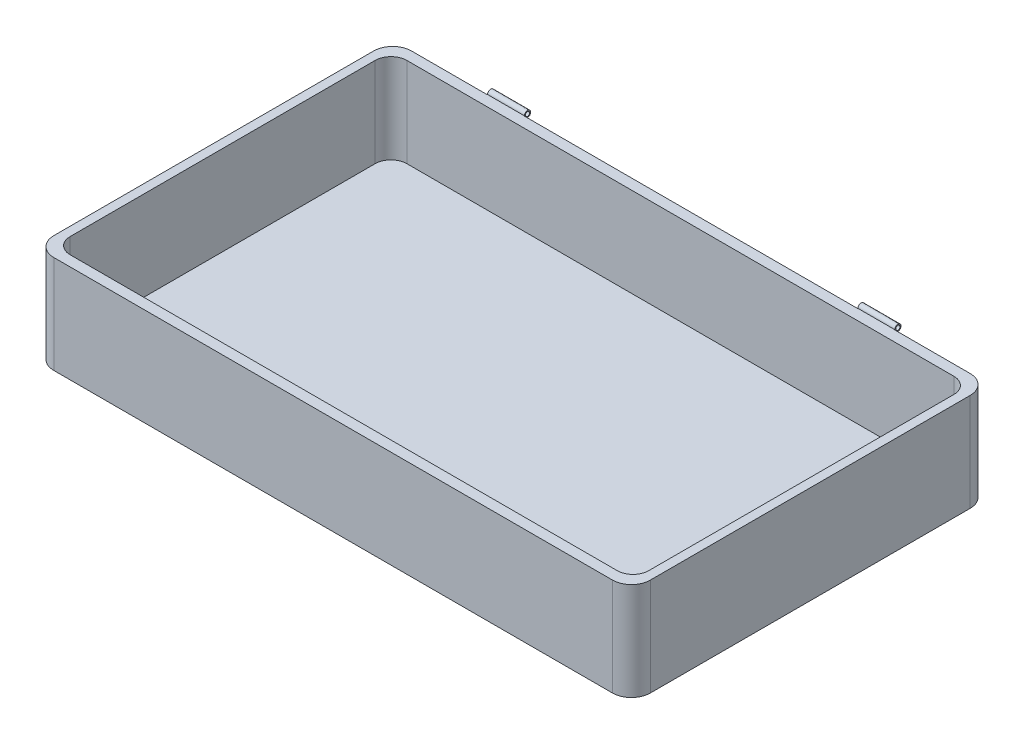
ISO-10303-21;
HEADER;
FILE_DESCRIPTION(('STEP AP214'),'2;1');
FILE_NAME('part.step','',(''),(''),'','','');
FILE_SCHEMA(('AUTOMOTIVE_DESIGN { 1 0 10303 214 1 1 1 1 }'));
ENDSEC;
DATA;
#1=APPLICATION_CONTEXT('core data for automotive mechanical design processes');
#2=APPLICATION_PROTOCOL_DEFINITION('international standard','automotive_design',2000,#1);
#3=PRODUCT_CONTEXT('',#1,'mechanical');
#4=PRODUCT('Part','Part','',(#3));
#5=PRODUCT_RELATED_PRODUCT_CATEGORY('part','',(#4));
#6=PRODUCT_DEFINITION_FORMATION('','',#4);
#7=PRODUCT_DEFINITION_CONTEXT('part definition',#1,'design');
#8=PRODUCT_DEFINITION('design','',#6,#7);
#9=PRODUCT_DEFINITION_SHAPE('','',#8);
#10=(LENGTH_UNIT() NAMED_UNIT(*) SI_UNIT(.MILLI.,.METRE.));
#11=(NAMED_UNIT(*) PLANE_ANGLE_UNIT() SI_UNIT($,.RADIAN.));
#12=(NAMED_UNIT(*) SI_UNIT($,.STERADIAN.) SOLID_ANGLE_UNIT());
#13=UNCERTAINTY_MEASURE_WITH_UNIT(LENGTH_MEASURE(1.E-05),#10,'distance_accuracy_value','');
#14=(GEOMETRIC_REPRESENTATION_CONTEXT(3) GLOBAL_UNCERTAINTY_ASSIGNED_CONTEXT((#13)) GLOBAL_UNIT_ASSIGNED_CONTEXT((#10,
#11,#12)) REPRESENTATION_CONTEXT('',''));
#15=CARTESIAN_POINT('',(0.,0.,0.));
#16=DIRECTION('',(0.,0.,1.));
#17=DIRECTION('',(1.,0.,0.));
#18=AXIS2_PLACEMENT_3D('',#15,#16,#17);
#19=CARTESIAN_POINT('',(0.,93.,0.));
#20=DIRECTION('',(0.,-1.,0.));
#21=DIRECTION('',(0.,0.,-1.));
#22=AXIS2_PLACEMENT_3D('',#19,#20,#21);
#23=PLANE('',#22);
#24=DIRECTION('',(0.,0.,-1.));
#25=VECTOR('',#24,1.);
#26=CARTESIAN_POINT('',(275.,93.,145.));
#27=LINE('',#26,#25);
#28=CARTESIAN_POINT('',(275.,93.,145.));
#29=VERTEX_POINT('',#28);
#30=CARTESIAN_POINT('',(275.,93.,-145.));
#31=VERTEX_POINT('',#30);
#32=EDGE_CURVE('E422',#29,#31,#27,.T.);
#33=ORIENTED_EDGE('',*,*,#32,.F.);
#34=CARTESIAN_POINT('',(260.,93.,145.));
#35=DIRECTION('',(0.,1.,0.));
#36=DIRECTION('',(0.,0.,1.));
#37=AXIS2_PLACEMENT_3D('',#34,#35,#36);
#38=CIRCLE('',#37,15.);
#39=CARTESIAN_POINT('',(260.,93.,160.));
#40=VERTEX_POINT('',#39);
#41=EDGE_CURVE('E394',#40,#29,#38,.T.);
#42=ORIENTED_EDGE('',*,*,#41,.F.);
#43=DIRECTION('',(1.,0.,0.));
#44=VECTOR('',#43,1.);
#45=CARTESIAN_POINT('',(-260.,93.,160.));
#46=LINE('',#45,#44);
#47=CARTESIAN_POINT('',(-260.,93.,160.));
#48=VERTEX_POINT('',#47);
#49=EDGE_CURVE('E399',#48,#40,#46,.T.);
#50=ORIENTED_EDGE('',*,*,#49,.F.);
#51=CARTESIAN_POINT('',(-260.,93.,145.));
#52=DIRECTION('',(0.,1.,0.));
#53=DIRECTION('',(0.,0.,1.));
#54=AXIS2_PLACEMENT_3D('',#51,#52,#53);
#55=CIRCLE('',#54,15.);
#56=CARTESIAN_POINT('',(-275.,93.,145.));
#57=VERTEX_POINT('',#56);
#58=EDGE_CURVE('E437',#57,#48,#55,.T.);
#59=ORIENTED_EDGE('',*,*,#58,.F.);
#60=DIRECTION('',(0.,0.,1.));
#61=VECTOR('',#60,1.);
#62=CARTESIAN_POINT('',(-275.,93.,145.));
#63=LINE('',#62,#61);
#64=CARTESIAN_POINT('',(-275.,93.,-145.));
#65=VERTEX_POINT('',#64);
#66=EDGE_CURVE('E434',#65,#57,#63,.T.);
#67=ORIENTED_EDGE('',*,*,#66,.F.);
#68=CARTESIAN_POINT('',(-260.,93.,-145.));
#69=DIRECTION('',(0.,1.,0.));
#70=DIRECTION('',(0.,0.,-1.));
#71=AXIS2_PLACEMENT_3D('',#68,#69,#70);
#72=CIRCLE('',#71,15.);
#73=CARTESIAN_POINT('',(-260.,93.,-160.));
#74=VERTEX_POINT('',#73);
#75=EDGE_CURVE('E431',#74,#65,#72,.T.);
#76=ORIENTED_EDGE('',*,*,#75,.F.);
#77=DIRECTION('',(-1.,0.,0.));
#78=VECTOR('',#77,1.);
#79=CARTESIAN_POINT('',(-260.,93.,-160.));
#80=LINE('',#79,#78);
#81=CARTESIAN_POINT('',(260.,93.,-160.));
#82=VERTEX_POINT('',#81);
#83=EDGE_CURVE('E428',#82,#74,#80,.T.);
#84=ORIENTED_EDGE('',*,*,#83,.F.);
#85=CARTESIAN_POINT('',(260.,93.,-145.));
#86=DIRECTION('',(0.,1.,0.));
#87=DIRECTION('',(0.,0.,1.));
#88=AXIS2_PLACEMENT_3D('',#85,#86,#87);
#89=CIRCLE('',#88,15.);
#90=EDGE_CURVE('E425',#31,#82,#89,.T.);
#91=ORIENTED_EDGE('',*,*,#90,.F.);
#92=EDGE_LOOP('',(#33,#42,#50,#59,#67,#76,#84,#91));
#93=FACE_BOUND('',#92,.T.);
#94=DIRECTION('',(-1.,0.,0.));
#95=VECTOR('',#94,1.);
#96=CARTESIAN_POINT('',(-158.5,93.,-170.25));
#97=LINE('',#96,#95);
#98=CARTESIAN_POINT('',(-193.5,93.,-170.25));
#99=VERTEX_POINT('',#98);
#100=CARTESIAN_POINT('',(-158.5,93.,-170.25));
#101=VERTEX_POINT('',#100);
#102=EDGE_CURVE('E341',#99,#101,#97,.F.);
#103=ORIENTED_EDGE('',*,*,#102,.F.);
#104=DIRECTION('',(0.,0.,1.));
#105=VECTOR('',#104,1.);
#106=CARTESIAN_POINT('',(-193.5,93.,-170.));
#107=LINE('',#106,#105);
#108=CARTESIAN_POINT('',(-193.5,93.,-170.));
#109=VERTEX_POINT('',#108);
#110=EDGE_CURVE('E340',#99,#109,#107,.T.);
#111=ORIENTED_EDGE('',*,*,#110,.T.);
#112=DIRECTION('',(-1.,0.,0.));
#113=VECTOR('',#112,1.);
#114=CARTESIAN_POINT('',(-283.5,93.,-170.));
#115=LINE('',#114,#113);
#116=CARTESIAN_POINT('',(-265.5,93.,-170.));
#117=VERTEX_POINT('',#116);
#118=EDGE_CURVE('E232',#109,#117,#115,.T.);
#119=ORIENTED_EDGE('',*,*,#118,.T.);
#120=CARTESIAN_POINT('',(-265.5,93.,-152.));
#121=DIRECTION('',(0.,-1.,0.));
#122=DIRECTION('',(0.,0.,-1.));
#123=AXIS2_PLACEMENT_3D('',#120,#121,#122);
#124=CIRCLE('',#123,18.);
#125=CARTESIAN_POINT('',(-283.5,93.,-152.));
#126=VERTEX_POINT('',#125);
#127=EDGE_CURVE('E287',#117,#126,#124,.F.);
#128=ORIENTED_EDGE('',*,*,#127,.T.);
#129=DIRECTION('',(0.,0.,1.));
#130=VECTOR('',#129,1.);
#131=CARTESIAN_POINT('',(-283.5,93.,170.));
#132=LINE('',#131,#130);
#133=CARTESIAN_POINT('',(-283.5,93.,152.));
#134=VERTEX_POINT('',#133);
#135=EDGE_CURVE('E238',#126,#134,#132,.T.);
#136=ORIENTED_EDGE('',*,*,#135,.T.);
#137=CARTESIAN_POINT('',(-265.5,93.,152.));
#138=DIRECTION('',(0.,-1.,0.));
#139=DIRECTION('',(0.,0.,-1.));
#140=AXIS2_PLACEMENT_3D('',#137,#138,#139);
#141=CIRCLE('',#140,18.);
#142=CARTESIAN_POINT('',(-265.5,93.,170.));
#143=VERTEX_POINT('',#142);
#144=EDGE_CURVE('E285',#134,#143,#141,.F.);
#145=ORIENTED_EDGE('',*,*,#144,.T.);
#146=DIRECTION('',(1.,0.,0.));
#147=VECTOR('',#146,1.);
#148=CARTESIAN_POINT('',(-283.5,93.,170.));
#149=LINE('',#148,#147);
#150=CARTESIAN_POINT('',(265.5,93.,170.));
#151=VERTEX_POINT('',#150);
#152=EDGE_CURVE('E245',#143,#151,#149,.T.);
#153=ORIENTED_EDGE('',*,*,#152,.T.);
#154=CARTESIAN_POINT('',(265.5,93.,152.));
#155=DIRECTION('',(0.,-1.,0.));
#156=DIRECTION('',(0.,0.,-1.));
#157=AXIS2_PLACEMENT_3D('',#154,#155,#156);
#158=CIRCLE('',#157,18.);
#159=CARTESIAN_POINT('',(283.5,93.,152.));
#160=VERTEX_POINT('',#159);
#161=EDGE_CURVE('E280',#151,#160,#158,.F.);
#162=ORIENTED_EDGE('',*,*,#161,.T.);
#163=DIRECTION('',(0.,0.,-1.));
#164=VECTOR('',#163,1.);
#165=CARTESIAN_POINT('',(283.5,93.,170.));
#166=LINE('',#165,#164);
#167=CARTESIAN_POINT('',(283.5,93.,-152.));
#168=VERTEX_POINT('',#167);
#169=EDGE_CURVE('E239',#160,#168,#166,.T.);
#170=ORIENTED_EDGE('',*,*,#169,.T.);
#171=CARTESIAN_POINT('',(265.5,93.,-152.));
#172=DIRECTION('',(0.,-1.,0.));
#173=DIRECTION('',(0.,0.,-1.));
#174=AXIS2_PLACEMENT_3D('',#171,#172,#173);
#175=CIRCLE('',#174,18.);
#176=CARTESIAN_POINT('',(265.5,93.,-170.));
#177=VERTEX_POINT('',#176);
#178=EDGE_CURVE('E282',#168,#177,#175,.F.);
#179=ORIENTED_EDGE('',*,*,#178,.T.);
#180=CARTESIAN_POINT('',(193.5,93.,-170.));
#181=VERTEX_POINT('',#180);
#182=EDGE_CURVE('E231',#177,#181,#115,.T.);
#183=ORIENTED_EDGE('',*,*,#182,.T.);
#184=DIRECTION('',(0.,0.,1.));
#185=VECTOR('',#184,1.);
#186=CARTESIAN_POINT('',(193.5,93.,-170.));
#187=LINE('',#186,#185);
#188=CARTESIAN_POINT('',(193.5,93.,-170.25));
#189=VERTEX_POINT('',#188);
#190=EDGE_CURVE('E319',#189,#181,#187,.T.);
#191=ORIENTED_EDGE('',*,*,#190,.F.);
#192=DIRECTION('',(1.,0.,0.));
#193=VECTOR('',#192,1.);
#194=CARTESIAN_POINT('',(158.5,93.,-170.25));
#195=LINE('',#194,#193);
#196=CARTESIAN_POINT('',(158.5,93.,-170.25));
#197=VERTEX_POINT('',#196);
#198=EDGE_CURVE('E371',#189,#197,#195,.F.);
#199=ORIENTED_EDGE('',*,*,#198,.T.);
#200=DIRECTION('',(0.,0.,1.));
#201=VECTOR('',#200,1.);
#202=CARTESIAN_POINT('',(158.5,93.,-170.));
#203=LINE('',#202,#201);
#204=CARTESIAN_POINT('',(158.5,93.,-170.));
#205=VERTEX_POINT('',#204);
#206=EDGE_CURVE('E228',#197,#205,#203,.T.);
#207=ORIENTED_EDGE('',*,*,#206,.T.);
#208=CARTESIAN_POINT('',(-158.5,93.,-170.));
#209=VERTEX_POINT('',#208);
#210=EDGE_CURVE('E220',#205,#209,#115,.T.);
#211=ORIENTED_EDGE('',*,*,#210,.T.);
#212=DIRECTION('',(0.,0.,1.));
#213=VECTOR('',#212,1.);
#214=CARTESIAN_POINT('',(-158.5,93.,-170.));
#215=LINE('',#214,#213);
#216=EDGE_CURVE('E54',#101,#209,#215,.T.);
#217=ORIENTED_EDGE('',*,*,#216,.F.);
#218=EDGE_LOOP('',(#103,#111,#119,#128,#136,#145,#153,#162,#170,#179,#183,#191,#199,#207,#211,#217));
#219=FACE_BOUND('',#218,.T.);
#220=ADVANCED_FACE('F39',(#93,#219),#23,.F.);
#221=CARTESIAN_POINT('',(-158.5,92.,-170.));
#222=DIRECTION('',(0.,1.,0.));
#223=DIRECTION('',(0.,0.,1.));
#224=AXIS2_PLACEMENT_3D('',#221,#222,#223);
#225=PLANE('',#224);
#226=DIRECTION('',(-1.,0.,0.));
#227=VECTOR('',#226,1.);
#228=CARTESIAN_POINT('',(-158.5,92.,-170.421572875254));
#229=LINE('',#228,#227);
#230=CARTESIAN_POINT('',(-158.5,92.,-170.421572875254));
#231=VERTEX_POINT('',#230);
#232=CARTESIAN_POINT('',(-193.5,92.,-170.421572875254));
#233=VERTEX_POINT('',#232);
#234=EDGE_CURVE('E62',#231,#233,#229,.T.);
#235=ORIENTED_EDGE('',*,*,#234,.F.);
#236=DIRECTION('',(0.,0.,-1.));
#237=VECTOR('',#236,1.);
#238=CARTESIAN_POINT('',(-158.5,92.,-170.));
#239=LINE('',#238,#237);
#240=CARTESIAN_POINT('',(-158.5,92.,-170.));
#241=VERTEX_POINT('',#240);
#242=EDGE_CURVE('E214',#241,#231,#239,.T.);
#243=ORIENTED_EDGE('',*,*,#242,.F.);
#244=DIRECTION('',(-1.,0.,0.));
#245=VECTOR('',#244,1.);
#246=CARTESIAN_POINT('',(-158.5,92.,-170.));
#247=LINE('',#246,#245);
#248=CARTESIAN_POINT('',(-193.5,92.,-170.));
#249=VERTEX_POINT('',#248);
#250=EDGE_CURVE('E223',#241,#249,#247,.T.);
#251=ORIENTED_EDGE('',*,*,#250,.T.);
#252=DIRECTION('',(0.,0.,-1.));
#253=VECTOR('',#252,1.);
#254=CARTESIAN_POINT('',(-193.5,92.,-170.));
#255=LINE('',#254,#253);
#256=EDGE_CURVE('E224',#249,#233,#255,.T.);
#257=ORIENTED_EDGE('',*,*,#256,.T.);
#258=EDGE_LOOP('',(#235,#243,#251,#257));
#259=FACE_BOUND('',#258,.T.);
#260=ADVANCED_FACE('F499',(#259),#225,.F.);
#261=CARTESIAN_POINT('',(-283.5,93.,-170.));
#262=DIRECTION('',(0.,0.,1.));
#263=DIRECTION('',(1.,0.,0.));
#264=AXIS2_PLACEMENT_3D('',#261,#262,#263);
#265=PLANE('',#264);
#266=DIRECTION('',(0.,-1.,0.));
#267=VECTOR('',#266,1.);
#268=CARTESIAN_POINT('',(-158.5,93.,-170.));
#269=LINE('',#268,#267);
#270=EDGE_CURVE('E210',#209,#241,#269,.T.);
#271=ORIENTED_EDGE('',*,*,#270,.F.);
#272=ORIENTED_EDGE('',*,*,#210,.F.);
#273=DIRECTION('',(0.,-1.,0.));
#274=VECTOR('',#273,1.);
#275=CARTESIAN_POINT('',(158.5,93.,-170.));
#276=LINE('',#275,#274);
#277=CARTESIAN_POINT('',(158.5,92.,-170.));
#278=VERTEX_POINT('',#277);
#279=EDGE_CURVE('E374',#205,#278,#276,.T.);
#280=ORIENTED_EDGE('',*,*,#279,.T.);
#281=DIRECTION('',(1.,0.,0.));
#282=VECTOR('',#281,1.);
#283=CARTESIAN_POINT('',(158.5,92.,-170.));
#284=LINE('',#283,#282);
#285=CARTESIAN_POINT('',(193.5,92.,-170.));
#286=VERTEX_POINT('',#285);
#287=EDGE_CURVE('E383',#278,#286,#284,.T.);
#288=ORIENTED_EDGE('',*,*,#287,.T.);
#289=DIRECTION('',(0.,-1.,0.));
#290=VECTOR('',#289,1.);
#291=CARTESIAN_POINT('',(193.5,93.,-170.));
#292=LINE('',#291,#290);
#293=EDGE_CURVE('E317',#181,#286,#292,.T.);
#294=ORIENTED_EDGE('',*,*,#293,.F.);
#295=ORIENTED_EDGE('',*,*,#182,.F.);
#296=DIRECTION('',(0.,-1.,0.));
#297=VECTOR('',#296,1.);
#298=CARTESIAN_POINT('',(265.5,93.,-170.));
#299=LINE('',#298,#297);
#300=CARTESIAN_POINT('',(265.5,0.,-170.));
#301=VERTEX_POINT('',#300);
#302=EDGE_CURVE('E274',#177,#301,#299,.T.);
#303=ORIENTED_EDGE('',*,*,#302,.T.);
#304=DIRECTION('',(-1.,0.,0.));
#305=VECTOR('',#304,1.);
#306=CARTESIAN_POINT('',(-283.5,0.,-170.));
#307=LINE('',#306,#305);
#308=CARTESIAN_POINT('',(-265.5,0.,-170.));
#309=VERTEX_POINT('',#308);
#310=EDGE_CURVE('E252',#301,#309,#307,.T.);
#311=ORIENTED_EDGE('',*,*,#310,.T.);
#312=DIRECTION('',(0.,-1.,0.));
#313=VECTOR('',#312,1.);
#314=CARTESIAN_POINT('',(-265.5,93.,-170.));
#315=LINE('',#314,#313);
#316=EDGE_CURVE('E277',#309,#117,#315,.F.);
#317=ORIENTED_EDGE('',*,*,#316,.T.);
#318=ORIENTED_EDGE('',*,*,#118,.F.);
#319=DIRECTION('',(0.,-1.,0.));
#320=VECTOR('',#319,1.);
#321=CARTESIAN_POINT('',(-193.5,93.,-170.));
#322=LINE('',#321,#320);
#323=EDGE_CURVE('E338',#109,#249,#322,.T.);
#324=ORIENTED_EDGE('',*,*,#323,.T.);
#325=ORIENTED_EDGE('',*,*,#250,.F.);
#326=EDGE_LOOP('',(#271,#272,#280,#288,#294,#295,#303,#311,#317,#318,#324,#325));
#327=FACE_BOUND('',#326,.T.);
#328=ADVANCED_FACE('F218',(#327),#265,.F.);
#329=CARTESIAN_POINT('',(283.5,93.,170.));
#330=DIRECTION('',(-1.,0.,0.));
#331=DIRECTION('',(0.,0.,1.));
#332=AXIS2_PLACEMENT_3D('',#329,#330,#331);
#333=PLANE('',#332);
#334=DIRECTION('',(0.,0.,-1.));
#335=VECTOR('',#334,1.);
#336=CARTESIAN_POINT('',(283.5,0.,170.));
#337=LINE('',#336,#335);
#338=CARTESIAN_POINT('',(283.5,0.,152.));
#339=VERTEX_POINT('',#338);
#340=CARTESIAN_POINT('',(283.5,0.,-152.));
#341=VERTEX_POINT('',#340);
#342=EDGE_CURVE('E249',#339,#341,#337,.T.);
#343=ORIENTED_EDGE('',*,*,#342,.T.);
#344=DIRECTION('',(0.,-1.,0.));
#345=VECTOR('',#344,1.);
#346=CARTESIAN_POINT('',(283.5,93.,-152.));
#347=LINE('',#346,#345);
#348=EDGE_CURVE('E11',#341,#168,#347,.F.);
#349=ORIENTED_EDGE('',*,*,#348,.T.);
#350=ORIENTED_EDGE('',*,*,#169,.F.);
#351=DIRECTION('',(0.,-1.,0.));
#352=VECTOR('',#351,1.);
#353=CARTESIAN_POINT('',(283.5,93.,152.));
#354=LINE('',#353,#352);
#355=EDGE_CURVE('E47',#160,#339,#354,.T.);
#356=ORIENTED_EDGE('',*,*,#355,.T.);
#357=EDGE_LOOP('',(#343,#349,#350,#356));
#358=FACE_BOUND('',#357,.T.);
#359=ADVANCED_FACE('F298',(#358),#333,.F.);
#360=CARTESIAN_POINT('',(-283.5,93.,170.));
#361=DIRECTION('',(1.,0.,0.));
#362=DIRECTION('',(0.,0.,-1.));
#363=AXIS2_PLACEMENT_3D('',#360,#361,#362);
#364=PLANE('',#363);
#365=ORIENTED_EDGE('',*,*,#135,.F.);
#366=DIRECTION('',(0.,-1.,0.));
#367=VECTOR('',#366,1.);
#368=CARTESIAN_POINT('',(-283.5,93.,-152.));
#369=LINE('',#368,#367);
#370=CARTESIAN_POINT('',(-283.5,0.,-152.));
#371=VERTEX_POINT('',#370);
#372=EDGE_CURVE('E263',#126,#371,#369,.T.);
#373=ORIENTED_EDGE('',*,*,#372,.T.);
#374=DIRECTION('',(0.,0.,1.));
#375=VECTOR('',#374,1.);
#376=CARTESIAN_POINT('',(-283.5,0.,170.));
#377=LINE('',#376,#375);
#378=CARTESIAN_POINT('',(-283.5,0.,152.));
#379=VERTEX_POINT('',#378);
#380=EDGE_CURVE('E256',#371,#379,#377,.T.);
#381=ORIENTED_EDGE('',*,*,#380,.T.);
#382=DIRECTION('',(0.,-1.,0.));
#383=VECTOR('',#382,1.);
#384=CARTESIAN_POINT('',(-283.5,93.,152.));
#385=LINE('',#384,#383);
#386=EDGE_CURVE('E248',#379,#134,#385,.F.);
#387=ORIENTED_EDGE('',*,*,#386,.T.);
#388=EDGE_LOOP('',(#365,#373,#381,#387));
#389=FACE_BOUND('',#388,.T.);
#390=ADVANCED_FACE('F329',(#389),#364,.F.);
#391=CARTESIAN_POINT('',(-283.5,93.,170.));
#392=DIRECTION('',(0.,0.,-1.));
#393=DIRECTION('',(-1.,0.,0.));
#394=AXIS2_PLACEMENT_3D('',#391,#392,#393);
#395=PLANE('',#394);
#396=ORIENTED_EDGE('',*,*,#152,.F.);
#397=DIRECTION('',(0.,-1.,0.));
#398=VECTOR('',#397,1.);
#399=CARTESIAN_POINT('',(-265.5,93.,170.));
#400=LINE('',#399,#398);
#401=CARTESIAN_POINT('',(-265.5,0.,170.));
#402=VERTEX_POINT('',#401);
#403=EDGE_CURVE('E291',#143,#402,#400,.T.);
#404=ORIENTED_EDGE('',*,*,#403,.T.);
#405=DIRECTION('',(1.,0.,0.));
#406=VECTOR('',#405,1.);
#407=CARTESIAN_POINT('',(-283.5,0.,170.));
#408=LINE('',#407,#406);
#409=CARTESIAN_POINT('',(265.5,0.,170.));
#410=VERTEX_POINT('',#409);
#411=EDGE_CURVE('E259',#402,#410,#408,.T.);
#412=ORIENTED_EDGE('',*,*,#411,.T.);
#413=DIRECTION('',(0.,-1.,0.));
#414=VECTOR('',#413,1.);
#415=CARTESIAN_POINT('',(265.5,93.,170.));
#416=LINE('',#415,#414);
#417=EDGE_CURVE('E289',#410,#151,#416,.F.);
#418=ORIENTED_EDGE('',*,*,#417,.T.);
#419=EDGE_LOOP('',(#396,#404,#412,#418));
#420=FACE_BOUND('',#419,.T.);
#421=ADVANCED_FACE('F323',(#420),#395,.F.);
#422=CARTESIAN_POINT('',(0.,0.,0.));
#423=DIRECTION('',(0.,-1.,0.));
#424=DIRECTION('',(0.,0.,-1.));
#425=AXIS2_PLACEMENT_3D('',#422,#423,#424);
#426=PLANE('',#425);
#427=ORIENTED_EDGE('',*,*,#380,.F.);
#428=CARTESIAN_POINT('',(-265.5,0.,-152.));
#429=DIRECTION('',(0.,-1.,0.));
#430=DIRECTION('',(0.,0.,-1.));
#431=AXIS2_PLACEMENT_3D('',#428,#429,#430);
#432=CIRCLE('',#431,18.);
#433=EDGE_CURVE('E272',#371,#309,#432,.T.);
#434=ORIENTED_EDGE('',*,*,#433,.T.);
#435=ORIENTED_EDGE('',*,*,#310,.F.);
#436=CARTESIAN_POINT('',(265.5,0.,-152.));
#437=DIRECTION('',(0.,-1.,0.));
#438=DIRECTION('',(0.,0.,-1.));
#439=AXIS2_PLACEMENT_3D('',#436,#437,#438);
#440=CIRCLE('',#439,18.);
#441=EDGE_CURVE('E268',#301,#341,#440,.T.);
#442=ORIENTED_EDGE('',*,*,#441,.T.);
#443=ORIENTED_EDGE('',*,*,#342,.F.);
#444=CARTESIAN_POINT('',(265.5,0.,152.));
#445=DIRECTION('',(0.,-1.,0.));
#446=DIRECTION('',(0.,0.,-1.));
#447=AXIS2_PLACEMENT_3D('',#444,#445,#446);
#448=CIRCLE('',#447,18.);
#449=EDGE_CURVE('E266',#339,#410,#448,.T.);
#450=ORIENTED_EDGE('',*,*,#449,.T.);
#451=ORIENTED_EDGE('',*,*,#411,.F.);
#452=CARTESIAN_POINT('',(-265.5,0.,152.));
#453=DIRECTION('',(0.,-1.,0.));
#454=DIRECTION('',(0.,0.,-1.));
#455=AXIS2_PLACEMENT_3D('',#452,#453,#454);
#456=CIRCLE('',#455,18.);
#457=EDGE_CURVE('E270',#402,#379,#456,.T.);
#458=ORIENTED_EDGE('',*,*,#457,.T.);
#459=EDGE_LOOP('',(#427,#434,#435,#442,#443,#450,#451,#458));
#460=FACE_BOUND('',#459,.T.);
#461=ADVANCED_FACE('F305',(#460),#426,.T.);
#462=CARTESIAN_POINT('',(260.,7.99999999999999,145.));
#463=DIRECTION('',(0.,1.,0.));
#464=DIRECTION('',(0.,0.,1.));
#465=AXIS2_PLACEMENT_3D('',#462,#463,#464);
#466=CYLINDRICAL_SURFACE('',#465,15.);
#467=ORIENTED_EDGE('',*,*,#41,.T.);
#468=DIRECTION('',(0.,1.,0.));
#469=VECTOR('',#468,1.);
#470=CARTESIAN_POINT('',(275.,7.99999999999999,145.));
#471=LINE('',#470,#469);
#472=CARTESIAN_POINT('',(275.,7.99999999999999,145.));
#473=VERTEX_POINT('',#472);
#474=EDGE_CURVE('E420',#473,#29,#471,.T.);
#475=ORIENTED_EDGE('',*,*,#474,.F.);
#476=CARTESIAN_POINT('',(260.,7.99999999999999,145.));
#477=DIRECTION('',(0.,1.,0.));
#478=DIRECTION('',(0.,0.,1.));
#479=AXIS2_PLACEMENT_3D('',#476,#477,#478);
#480=CIRCLE('',#479,15.);
#481=CARTESIAN_POINT('',(260.,7.99999999999999,160.));
#482=VERTEX_POINT('',#481);
#483=EDGE_CURVE('E395',#482,#473,#480,.T.);
#484=ORIENTED_EDGE('',*,*,#483,.F.);
#485=DIRECTION('',(0.,1.,0.));
#486=VECTOR('',#485,1.);
#487=CARTESIAN_POINT('',(260.,7.99999999999999,160.));
#488=LINE('',#487,#486);
#489=EDGE_CURVE('E253',#482,#40,#488,.T.);
#490=ORIENTED_EDGE('',*,*,#489,.T.);
#491=EDGE_LOOP('',(#467,#475,#484,#490));
#492=FACE_BOUND('',#491,.T.);
#493=ADVANCED_FACE('F474',(#492),#466,.F.);
#494=CARTESIAN_POINT('',(-260.,7.99999999999999,160.));
#495=DIRECTION('',(0.,0.,1.));
#496=DIRECTION('',(1.,0.,0.));
#497=AXIS2_PLACEMENT_3D('',#494,#495,#496);
#498=PLANE('',#497);
#499=ORIENTED_EDGE('',*,*,#49,.T.);
#500=ORIENTED_EDGE('',*,*,#489,.F.);
#501=DIRECTION('',(1.,0.,0.));
#502=VECTOR('',#501,1.);
#503=CARTESIAN_POINT('',(-260.,7.99999999999999,160.));
#504=LINE('',#503,#502);
#505=CARTESIAN_POINT('',(-260.,7.99999999999999,160.));
#506=VERTEX_POINT('',#505);
#507=EDGE_CURVE('E417',#506,#482,#504,.T.);
#508=ORIENTED_EDGE('',*,*,#507,.F.);
#509=DIRECTION('',(0.,1.,0.));
#510=VECTOR('',#509,1.);
#511=CARTESIAN_POINT('',(-260.,7.99999999999999,160.));
#512=LINE('',#511,#510);
#513=EDGE_CURVE('E443',#506,#48,#512,.T.);
#514=ORIENTED_EDGE('',*,*,#513,.T.);
#515=EDGE_LOOP('',(#499,#500,#508,#514));
#516=FACE_BOUND('',#515,.T.);
#517=ADVANCED_FACE('F476',(#516),#498,.F.);
#518=CARTESIAN_POINT('',(-260.,7.99999999999999,145.));
#519=DIRECTION('',(0.,1.,0.));
#520=DIRECTION('',(0.,0.,1.));
#521=AXIS2_PLACEMENT_3D('',#518,#519,#520);
#522=CYLINDRICAL_SURFACE('',#521,15.);
#523=ORIENTED_EDGE('',*,*,#58,.T.);
#524=ORIENTED_EDGE('',*,*,#513,.F.);
#525=CARTESIAN_POINT('',(-260.,7.99999999999999,145.));
#526=DIRECTION('',(0.,1.,0.));
#527=DIRECTION('',(0.,0.,1.));
#528=AXIS2_PLACEMENT_3D('',#525,#526,#527);
#529=CIRCLE('',#528,15.);
#530=CARTESIAN_POINT('',(-275.,7.99999999999999,145.));
#531=VERTEX_POINT('',#530);
#532=EDGE_CURVE('E414',#531,#506,#529,.T.);
#533=ORIENTED_EDGE('',*,*,#532,.F.);
#534=DIRECTION('',(0.,1.,0.));
#535=VECTOR('',#534,1.);
#536=CARTESIAN_POINT('',(-275.,7.99999999999999,145.));
#537=LINE('',#536,#535);
#538=EDGE_CURVE('E445',#531,#57,#537,.T.);
#539=ORIENTED_EDGE('',*,*,#538,.T.);
#540=EDGE_LOOP('',(#523,#524,#533,#539));
#541=FACE_BOUND('',#540,.T.);
#542=ADVANCED_FACE('F480',(#541),#522,.F.);
#543=CARTESIAN_POINT('',(-275.,7.99999999999999,145.));
#544=DIRECTION('',(-1.,0.,0.));
#545=DIRECTION('',(0.,0.,1.));
#546=AXIS2_PLACEMENT_3D('',#543,#544,#545);
#547=PLANE('',#546);
#548=ORIENTED_EDGE('',*,*,#66,.T.);
#549=ORIENTED_EDGE('',*,*,#538,.F.);
#550=DIRECTION('',(0.,0.,1.));
#551=VECTOR('',#550,1.);
#552=CARTESIAN_POINT('',(-275.,7.99999999999999,145.));
#553=LINE('',#552,#551);
#554=CARTESIAN_POINT('',(-275.,7.99999999999999,-145.));
#555=VERTEX_POINT('',#554);
#556=EDGE_CURVE('E411',#555,#531,#553,.T.);
#557=ORIENTED_EDGE('',*,*,#556,.F.);
#558=DIRECTION('',(0.,1.,0.));
#559=VECTOR('',#558,1.);
#560=CARTESIAN_POINT('',(-275.,7.99999999999999,-145.));
#561=LINE('',#560,#559);
#562=EDGE_CURVE('E447',#555,#65,#561,.T.);
#563=ORIENTED_EDGE('',*,*,#562,.T.);
#564=EDGE_LOOP('',(#548,#549,#557,#563));
#565=FACE_BOUND('',#564,.T.);
#566=ADVANCED_FACE('F484',(#565),#547,.F.);
#567=CARTESIAN_POINT('',(-260.,7.99999999999999,-145.));
#568=DIRECTION('',(0.,1.,0.));
#569=DIRECTION('',(0.,0.,1.));
#570=AXIS2_PLACEMENT_3D('',#567,#568,#569);
#571=CYLINDRICAL_SURFACE('',#570,15.);
#572=ORIENTED_EDGE('',*,*,#75,.T.);
#573=ORIENTED_EDGE('',*,*,#562,.F.);
#574=CARTESIAN_POINT('',(-260.,7.99999999999999,-145.));
#575=DIRECTION('',(0.,1.,0.));
#576=DIRECTION('',(0.,0.,-1.));
#577=AXIS2_PLACEMENT_3D('',#574,#575,#576);
#578=CIRCLE('',#577,15.);
#579=CARTESIAN_POINT('',(-260.,7.99999999999999,-160.));
#580=VERTEX_POINT('',#579);
#581=EDGE_CURVE('E408',#580,#555,#578,.T.);
#582=ORIENTED_EDGE('',*,*,#581,.F.);
#583=DIRECTION('',(0.,1.,0.));
#584=VECTOR('',#583,1.);
#585=CARTESIAN_POINT('',(-260.,7.99999999999999,-160.));
#586=LINE('',#585,#584);
#587=EDGE_CURVE('E449',#580,#74,#586,.T.);
#588=ORIENTED_EDGE('',*,*,#587,.T.);
#589=EDGE_LOOP('',(#572,#573,#582,#588));
#590=FACE_BOUND('',#589,.T.);
#591=ADVANCED_FACE('F487',(#590),#571,.F.);
#592=CARTESIAN_POINT('',(-260.,7.99999999999999,-160.));
#593=DIRECTION('',(0.,0.,-1.));
#594=DIRECTION('',(-1.,0.,0.));
#595=AXIS2_PLACEMENT_3D('',#592,#593,#594);
#596=PLANE('',#595);
#597=ORIENTED_EDGE('',*,*,#83,.T.);
#598=ORIENTED_EDGE('',*,*,#587,.F.);
#599=DIRECTION('',(-1.,0.,0.));
#600=VECTOR('',#599,1.);
#601=CARTESIAN_POINT('',(-260.,7.99999999999999,-160.));
#602=LINE('',#601,#600);
#603=CARTESIAN_POINT('',(260.,7.99999999999999,-160.));
#604=VERTEX_POINT('',#603);
#605=EDGE_CURVE('E405',#604,#580,#602,.T.);
#606=ORIENTED_EDGE('',*,*,#605,.F.);
#607=DIRECTION('',(0.,1.,0.));
#608=VECTOR('',#607,1.);
#609=CARTESIAN_POINT('',(260.,7.99999999999999,-160.));
#610=LINE('',#609,#608);
#611=EDGE_CURVE('E451',#604,#82,#610,.T.);
#612=ORIENTED_EDGE('',*,*,#611,.T.);
#613=EDGE_LOOP('',(#597,#598,#606,#612));
#614=FACE_BOUND('',#613,.T.);
#615=ADVANCED_FACE('F489',(#614),#596,.F.);
#616=CARTESIAN_POINT('',(260.,7.99999999999999,-145.));
#617=DIRECTION('',(0.,1.,0.));
#618=DIRECTION('',(0.,0.,1.));
#619=AXIS2_PLACEMENT_3D('',#616,#617,#618);
#620=CYLINDRICAL_SURFACE('',#619,15.);
#621=ORIENTED_EDGE('',*,*,#90,.T.);
#622=ORIENTED_EDGE('',*,*,#611,.F.);
#623=CARTESIAN_POINT('',(260.,7.99999999999999,-145.));
#624=DIRECTION('',(0.,1.,0.));
#625=DIRECTION('',(0.,0.,1.));
#626=AXIS2_PLACEMENT_3D('',#623,#624,#625);
#627=CIRCLE('',#626,15.);
#628=CARTESIAN_POINT('',(275.,7.99999999999999,-145.));
#629=VERTEX_POINT('',#628);
#630=EDGE_CURVE('E402',#629,#604,#627,.T.);
#631=ORIENTED_EDGE('',*,*,#630,.F.);
#632=DIRECTION('',(0.,1.,0.));
#633=VECTOR('',#632,1.);
#634=CARTESIAN_POINT('',(275.,7.99999999999999,-145.));
#635=LINE('',#634,#633);
#636=EDGE_CURVE('E453',#629,#31,#635,.T.);
#637=ORIENTED_EDGE('',*,*,#636,.T.);
#638=EDGE_LOOP('',(#621,#622,#631,#637));
#639=FACE_BOUND('',#638,.T.);
#640=ADVANCED_FACE('F468',(#639),#620,.F.);
#641=CARTESIAN_POINT('',(275.,7.99999999999999,145.));
#642=DIRECTION('',(1.,0.,0.));
#643=DIRECTION('',(0.,0.,-1.));
#644=AXIS2_PLACEMENT_3D('',#641,#642,#643);
#645=PLANE('',#644);
#646=ORIENTED_EDGE('',*,*,#32,.T.);
#647=ORIENTED_EDGE('',*,*,#636,.F.);
#648=DIRECTION('',(0.,0.,-1.));
#649=VECTOR('',#648,1.);
#650=CARTESIAN_POINT('',(275.,7.99999999999999,145.));
#651=LINE('',#650,#649);
#652=EDGE_CURVE('E398',#473,#629,#651,.T.);
#653=ORIENTED_EDGE('',*,*,#652,.F.);
#654=ORIENTED_EDGE('',*,*,#474,.T.);
#655=EDGE_LOOP('',(#646,#647,#653,#654));
#656=FACE_BOUND('',#655,.T.);
#657=ADVANCED_FACE('F458',(#656),#645,.F.);
#658=CARTESIAN_POINT('',(260.,7.99999999999999,145.));
#659=DIRECTION('',(0.,1.,0.));
#660=DIRECTION('',(0.,0.,1.));
#661=AXIS2_PLACEMENT_3D('',#658,#659,#660);
#662=PLANE('',#661);
#663=ORIENTED_EDGE('',*,*,#483,.T.);
#664=ORIENTED_EDGE('',*,*,#652,.T.);
#665=ORIENTED_EDGE('',*,*,#630,.T.);
#666=ORIENTED_EDGE('',*,*,#605,.T.);
#667=ORIENTED_EDGE('',*,*,#581,.T.);
#668=ORIENTED_EDGE('',*,*,#556,.T.);
#669=ORIENTED_EDGE('',*,*,#532,.T.);
#670=ORIENTED_EDGE('',*,*,#507,.T.);
#671=EDGE_LOOP('',(#663,#664,#665,#666,#667,#668,#669,#670));
#672=FACE_BOUND('',#671,.T.);
#673=ADVANCED_FACE('F472',(#672),#662,.T.);
#674=CARTESIAN_POINT('',(-265.5,93.,-152.));
#675=DIRECTION('',(0.,-1.,0.));
#676=DIRECTION('',(0.,0.,-1.));
#677=AXIS2_PLACEMENT_3D('',#674,#675,#676);
#678=CYLINDRICAL_SURFACE('',#677,18.);
#679=ORIENTED_EDGE('',*,*,#127,.F.);
#680=ORIENTED_EDGE('',*,*,#316,.F.);
#681=ORIENTED_EDGE('',*,*,#433,.F.);
#682=ORIENTED_EDGE('',*,*,#372,.F.);
#683=EDGE_LOOP('',(#679,#680,#681,#682));
#684=FACE_BOUND('',#683,.T.);
#685=ADVANCED_FACE('F335',(#684),#678,.T.);
#686=CARTESIAN_POINT('',(-265.5,93.,152.));
#687=DIRECTION('',(0.,-1.,0.));
#688=DIRECTION('',(0.,0.,-1.));
#689=AXIS2_PLACEMENT_3D('',#686,#687,#688);
#690=CYLINDRICAL_SURFACE('',#689,18.);
#691=ORIENTED_EDGE('',*,*,#144,.F.);
#692=ORIENTED_EDGE('',*,*,#386,.F.);
#693=ORIENTED_EDGE('',*,*,#457,.F.);
#694=ORIENTED_EDGE('',*,*,#403,.F.);
#695=EDGE_LOOP('',(#691,#692,#693,#694));
#696=FACE_BOUND('',#695,.T.);
#697=ADVANCED_FACE('F332',(#696),#690,.T.);
#698=CARTESIAN_POINT('',(265.5,93.,-152.));
#699=DIRECTION('',(0.,-1.,0.));
#700=DIRECTION('',(0.,0.,-1.));
#701=AXIS2_PLACEMENT_3D('',#698,#699,#700);
#702=CYLINDRICAL_SURFACE('',#701,18.);
#703=ORIENTED_EDGE('',*,*,#178,.F.);
#704=ORIENTED_EDGE('',*,*,#348,.F.);
#705=ORIENTED_EDGE('',*,*,#441,.F.);
#706=ORIENTED_EDGE('',*,*,#302,.F.);
#707=EDGE_LOOP('',(#703,#704,#705,#706));
#708=FACE_BOUND('',#707,.T.);
#709=ADVANCED_FACE('F311',(#708),#702,.T.);
#710=CARTESIAN_POINT('',(265.5,93.,152.));
#711=DIRECTION('',(0.,-1.,0.));
#712=DIRECTION('',(0.,0.,-1.));
#713=AXIS2_PLACEMENT_3D('',#710,#711,#712);
#714=CYLINDRICAL_SURFACE('',#713,18.);
#715=ORIENTED_EDGE('',*,*,#161,.F.);
#716=ORIENTED_EDGE('',*,*,#417,.F.);
#717=ORIENTED_EDGE('',*,*,#449,.F.);
#718=ORIENTED_EDGE('',*,*,#355,.F.);
#719=EDGE_LOOP('',(#715,#716,#717,#718));
#720=FACE_BOUND('',#719,.T.);
#721=ADVANCED_FACE('F41',(#720),#714,.T.);
#722=CARTESIAN_POINT('',(158.5,92.,-170.));
#723=DIRECTION('',(0.,-1.,0.));
#724=DIRECTION('',(0.,0.,-1.));
#725=AXIS2_PLACEMENT_3D('',#722,#723,#724);
#726=PLANE('',#725);
#727=DIRECTION('',(1.,0.,0.));
#728=VECTOR('',#727,1.);
#729=CARTESIAN_POINT('',(158.5,92.,-170.421572875254));
#730=LINE('',#729,#728);
#731=CARTESIAN_POINT('',(193.5,92.,-170.421572875254));
#732=VERTEX_POINT('',#731);
#733=CARTESIAN_POINT('',(158.5,92.,-170.421572875254));
#734=VERTEX_POINT('',#733);
#735=EDGE_CURVE('E365',#732,#734,#730,.F.);
#736=ORIENTED_EDGE('',*,*,#735,.F.);
#737=DIRECTION('',(0.,0.,-1.));
#738=VECTOR('',#737,1.);
#739=CARTESIAN_POINT('',(193.5,92.,-170.));
#740=LINE('',#739,#738);
#741=EDGE_CURVE('E386',#286,#732,#740,.T.);
#742=ORIENTED_EDGE('',*,*,#741,.F.);
#743=ORIENTED_EDGE('',*,*,#287,.F.);
#744=DIRECTION('',(0.,0.,-1.));
#745=VECTOR('',#744,1.);
#746=CARTESIAN_POINT('',(158.5,92.,-170.));
#747=LINE('',#746,#745);
#748=EDGE_CURVE('E377',#278,#734,#747,.T.);
#749=ORIENTED_EDGE('',*,*,#748,.T.);
#750=EDGE_LOOP('',(#736,#742,#743,#749));
#751=FACE_BOUND('',#750,.T.);
#752=ADVANCED_FACE('F526',(#751),#726,.T.);
#753=CARTESIAN_POINT('',(158.5,0.,0.));
#754=DIRECTION('',(1.,0.,0.));
#755=DIRECTION('',(0.,0.,-1.));
#756=AXIS2_PLACEMENT_3D('',#753,#754,#755);
#757=PLANE('',#756);
#758=ORIENTED_EDGE('',*,*,#206,.F.);
#759=CARTESIAN_POINT('',(158.5,93.,-173.25));
#760=DIRECTION('',(1.,0.,0.));
#761=DIRECTION('',(0.,0.,-1.));
#762=AXIS2_PLACEMENT_3D('',#759,#760,#761);
#763=CIRCLE('',#762,2.99999999999999);
#764=EDGE_CURVE('E362',#734,#197,#763,.T.);
#765=ORIENTED_EDGE('',*,*,#764,.F.);
#766=ORIENTED_EDGE('',*,*,#748,.F.);
#767=ORIENTED_EDGE('',*,*,#279,.F.);
#768=EDGE_LOOP('',(#758,#765,#766,#767));
#769=FACE_BOUND('',#768,.T.);
#770=CARTESIAN_POINT('',(158.5,93.,-173.25));
#771=DIRECTION('',(1.,0.,0.));
#772=DIRECTION('',(0.,0.,-1.));
#773=AXIS2_PLACEMENT_3D('',#770,#771,#772);
#774=CIRCLE('',#773,2.);
#775=CARTESIAN_POINT('',(158.5,93.,-175.25));
#776=VERTEX_POINT('',#775);
#777=EDGE_CURVE('E357',#776,#776,#774,.T.);
#778=ORIENTED_EDGE('',*,*,#777,.T.);
#779=EDGE_LOOP('',(#778));
#780=FACE_BOUND('',#779,.T.);
#781=ADVANCED_FACE('F530',(#769,#780),#757,.F.);
#782=CARTESIAN_POINT('',(193.5,0.,0.));
#783=DIRECTION('',(1.,0.,0.));
#784=DIRECTION('',(0.,0.,-1.));
#785=AXIS2_PLACEMENT_3D('',#782,#783,#784);
#786=PLANE('',#785);
#787=CARTESIAN_POINT('',(193.5,93.,-173.25));
#788=DIRECTION('',(1.,0.,0.));
#789=DIRECTION('',(0.,0.,-1.));
#790=AXIS2_PLACEMENT_3D('',#787,#788,#789);
#791=CIRCLE('',#790,2.99999999999999);
#792=EDGE_CURVE('E361',#732,#189,#791,.T.);
#793=ORIENTED_EDGE('',*,*,#792,.T.);
#794=ORIENTED_EDGE('',*,*,#190,.T.);
#795=ORIENTED_EDGE('',*,*,#293,.T.);
#796=ORIENTED_EDGE('',*,*,#741,.T.);
#797=EDGE_LOOP('',(#793,#794,#795,#796));
#798=FACE_BOUND('',#797,.T.);
#799=CARTESIAN_POINT('',(193.5,93.,-173.25));
#800=DIRECTION('',(1.,0.,0.));
#801=DIRECTION('',(0.,0.,-1.));
#802=AXIS2_PLACEMENT_3D('',#799,#800,#801);
#803=CIRCLE('',#802,2.);
#804=CARTESIAN_POINT('',(193.5,93.,-175.25));
#805=VERTEX_POINT('',#804);
#806=EDGE_CURVE('E353',#805,#805,#803,.T.);
#807=ORIENTED_EDGE('',*,*,#806,.F.);
#808=EDGE_LOOP('',(#807));
#809=FACE_BOUND('',#808,.T.);
#810=ADVANCED_FACE('F536',(#798,#809),#786,.T.);
#811=CARTESIAN_POINT('',(158.5,93.,-173.25));
#812=DIRECTION('',(1.,0.,0.));
#813=DIRECTION('',(0.,0.,-1.));
#814=AXIS2_PLACEMENT_3D('',#811,#812,#813);
#815=CYLINDRICAL_SURFACE('',#814,2.99999999999999);
#816=ORIENTED_EDGE('',*,*,#198,.F.);
#817=ORIENTED_EDGE('',*,*,#792,.F.);
#818=ORIENTED_EDGE('',*,*,#735,.T.);
#819=ORIENTED_EDGE('',*,*,#764,.T.);
#820=EDGE_LOOP('',(#816,#817,#818,#819));
#821=FACE_BOUND('',#820,.T.);
#822=ADVANCED_FACE('F647',(#821),#815,.T.);
#823=CARTESIAN_POINT('',(-283.5,93.,-173.25));
#824=DIRECTION('',(1.,0.,0.));
#825=DIRECTION('',(0.,0.,-1.));
#826=AXIS2_PLACEMENT_3D('',#823,#824,#825);
#827=CYLINDRICAL_SURFACE('',#826,2.);
#828=ORIENTED_EDGE('',*,*,#806,.T.);
#829=EDGE_LOOP('',(#828));
#830=FACE_BOUND('',#829,.T.);
#831=ORIENTED_EDGE('',*,*,#777,.F.);
#832=EDGE_LOOP('',(#831));
#833=FACE_BOUND('',#832,.T.);
#834=ADVANCED_FACE('F657',(#830,#833),#827,.F.);
#835=CARTESIAN_POINT('',(-158.5,0.,0.));
#836=DIRECTION('',(-1.,0.,0.));
#837=DIRECTION('',(0.,0.,-1.));
#838=AXIS2_PLACEMENT_3D('',#835,#836,#837);
#839=PLANE('',#838);
#840=CARTESIAN_POINT('',(-158.5,93.,-173.25));
#841=DIRECTION('',(-1.,0.,0.));
#842=DIRECTION('',(0.,0.,1.));
#843=AXIS2_PLACEMENT_3D('',#840,#841,#842);
#844=CIRCLE('',#843,2.);
#845=CARTESIAN_POINT('',(-158.5,93.,-171.25));
#846=VERTEX_POINT('',#845);
#847=EDGE_CURVE('E731',#846,#846,#844,.F.);
#848=ORIENTED_EDGE('',*,*,#847,.F.);
#849=EDGE_LOOP('',(#848));
#850=FACE_BOUND('',#849,.T.);
#851=CARTESIAN_POINT('',(-158.5,93.,-173.25));
#852=DIRECTION('',(1.,0.,0.));
#853=DIRECTION('',(0.,0.,-1.));
#854=AXIS2_PLACEMENT_3D('',#851,#852,#853);
#855=CIRCLE('',#854,2.99999999999999);
#856=EDGE_CURVE('E213',#231,#101,#855,.T.);
#857=ORIENTED_EDGE('',*,*,#856,.T.);
#858=ORIENTED_EDGE('',*,*,#216,.T.);
#859=ORIENTED_EDGE('',*,*,#270,.T.);
#860=ORIENTED_EDGE('',*,*,#242,.T.);
#861=EDGE_LOOP('',(#857,#858,#859,#860));
#862=FACE_BOUND('',#861,.T.);
#863=ADVANCED_FACE('F209',(#850,#862),#839,.F.);
#864=CARTESIAN_POINT('',(-193.5,0.,0.));
#865=DIRECTION('',(-1.,0.,0.));
#866=DIRECTION('',(0.,0.,-1.));
#867=AXIS2_PLACEMENT_3D('',#864,#865,#866);
#868=PLANE('',#867);
#869=CARTESIAN_POINT('',(-193.5,93.,-173.25));
#870=DIRECTION('',(1.,0.,0.));
#871=DIRECTION('',(0.,0.,-1.));
#872=AXIS2_PLACEMENT_3D('',#869,#870,#871);
#873=CIRCLE('',#872,2.);
#874=CARTESIAN_POINT('',(-193.5,93.,-175.25));
#875=VERTEX_POINT('',#874);
#876=EDGE_CURVE('E728',#875,#875,#873,.T.);
#877=ORIENTED_EDGE('',*,*,#876,.T.);
#878=EDGE_LOOP('',(#877));
#879=FACE_BOUND('',#878,.T.);
#880=ORIENTED_EDGE('',*,*,#110,.F.);
#881=CARTESIAN_POINT('',(-193.5,93.,-173.25));
#882=DIRECTION('',(1.,0.,0.));
#883=DIRECTION('',(0.,0.,-1.));
#884=AXIS2_PLACEMENT_3D('',#881,#882,#883);
#885=CIRCLE('',#884,2.99999999999999);
#886=EDGE_CURVE('E732',#233,#99,#885,.T.);
#887=ORIENTED_EDGE('',*,*,#886,.F.);
#888=ORIENTED_EDGE('',*,*,#256,.F.);
#889=ORIENTED_EDGE('',*,*,#323,.F.);
#890=EDGE_LOOP('',(#880,#887,#888,#889));
#891=FACE_BOUND('',#890,.T.);
#892=ADVANCED_FACE('F346',(#879,#891),#868,.T.);
#893=CARTESIAN_POINT('',(-158.5,93.,-173.25));
#894=DIRECTION('',(-1.,0.,0.));
#895=DIRECTION('',(0.,0.,1.));
#896=AXIS2_PLACEMENT_3D('',#893,#894,#895);
#897=CYLINDRICAL_SURFACE('',#896,2.99999999999999);
#898=ORIENTED_EDGE('',*,*,#886,.T.);
#899=ORIENTED_EDGE('',*,*,#102,.T.);
#900=ORIENTED_EDGE('',*,*,#856,.F.);
#901=ORIENTED_EDGE('',*,*,#234,.T.);
#902=EDGE_LOOP('',(#898,#899,#900,#901));
#903=FACE_BOUND('',#902,.T.);
#904=ADVANCED_FACE('F689',(#903),#897,.T.);
#905=CARTESIAN_POINT('',(283.5,93.,-173.25));
#906=DIRECTION('',(-1.,0.,0.));
#907=DIRECTION('',(0.,0.,1.));
#908=AXIS2_PLACEMENT_3D('',#905,#906,#907);
#909=CYLINDRICAL_SURFACE('',#908,2.);
#910=ORIENTED_EDGE('',*,*,#876,.F.);
#911=EDGE_LOOP('',(#910));
#912=FACE_BOUND('',#911,.T.);
#913=ORIENTED_EDGE('',*,*,#847,.T.);
#914=EDGE_LOOP('',(#913));
#915=FACE_BOUND('',#914,.T.);
#916=ADVANCED_FACE('F694',(#912,#915),#909,.F.);
#917=CLOSED_SHELL('',(#220,#260,#328,#359,#390,#421,#461,#493,#517,#542,#566,#591,#615,#640,
#657,#673,#685,#697,#709,#721,#752,#781,#810,#822,#834,#863,#892,#904,#916));
#918=MANIFOLD_SOLID_BREP('B2',#917);
#919=ADVANCED_BREP_SHAPE_REPRESENTATION('',(#18,#918),#14);
#920=SHAPE_DEFINITION_REPRESENTATION(#9,#919);
ENDSEC;
END-ISO-10303-21;
